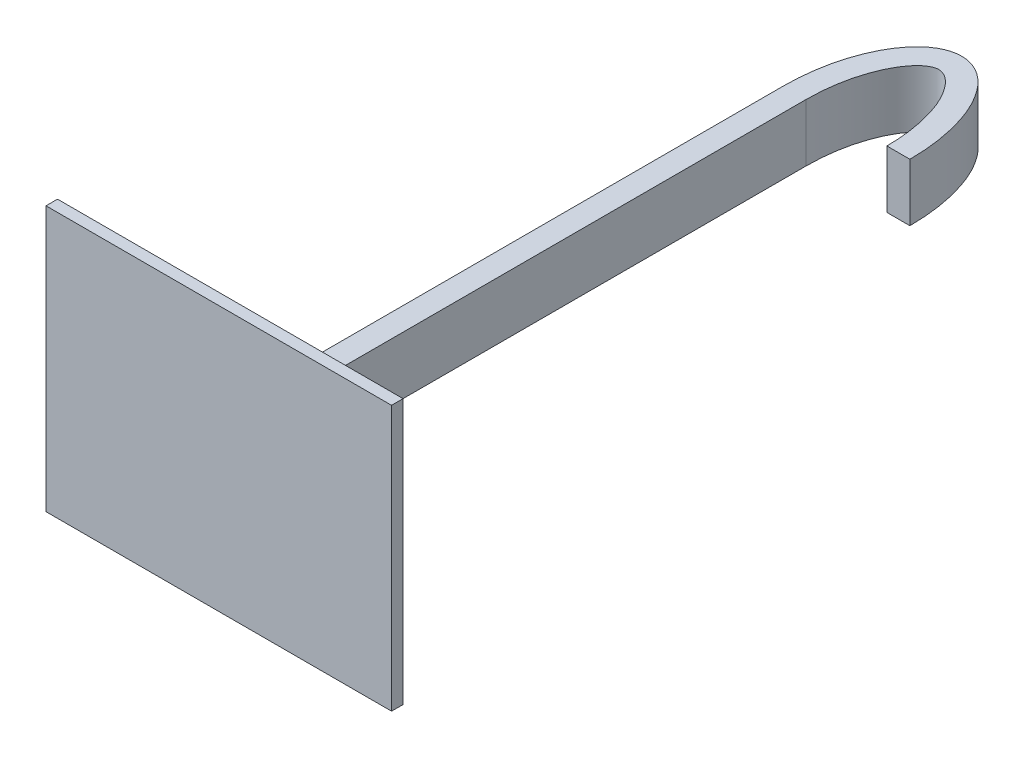
ISO-10303-21;
HEADER;
FILE_DESCRIPTION(('STEP AP214'),'2;1');
FILE_NAME('part.step','',(''),(''),'','','');
FILE_SCHEMA(('AUTOMOTIVE_DESIGN { 1 0 10303 214 1 1 1 1 }'));
ENDSEC;
DATA;
#1=APPLICATION_CONTEXT('core data for automotive mechanical design processes');
#2=APPLICATION_PROTOCOL_DEFINITION('international standard','automotive_design',2000,#1);
#3=PRODUCT_CONTEXT('',#1,'mechanical');
#4=PRODUCT('Part','Part','',(#3));
#5=PRODUCT_RELATED_PRODUCT_CATEGORY('part','',(#4));
#6=PRODUCT_DEFINITION_FORMATION('','',#4);
#7=PRODUCT_DEFINITION_CONTEXT('part definition',#1,'design');
#8=PRODUCT_DEFINITION('design','',#6,#7);
#9=PRODUCT_DEFINITION_SHAPE('','',#8);
#10=(LENGTH_UNIT() NAMED_UNIT(*) SI_UNIT(.MILLI.,.METRE.));
#11=(NAMED_UNIT(*) PLANE_ANGLE_UNIT() SI_UNIT($,.RADIAN.));
#12=(NAMED_UNIT(*) SI_UNIT($,.STERADIAN.) SOLID_ANGLE_UNIT());
#13=UNCERTAINTY_MEASURE_WITH_UNIT(LENGTH_MEASURE(1.E-05),#10,'distance_accuracy_value','');
#14=(GEOMETRIC_REPRESENTATION_CONTEXT(3) GLOBAL_UNCERTAINTY_ASSIGNED_CONTEXT((#13)) GLOBAL_UNIT_ASSIGNED_CONTEXT((#10,
#11,#12)) REPRESENTATION_CONTEXT('',''));
#15=CARTESIAN_POINT('',(0.,0.,0.));
#16=DIRECTION('',(0.,0.,1.));
#17=DIRECTION('',(1.,0.,0.));
#18=AXIS2_PLACEMENT_3D('',#15,#16,#17);
#19=CARTESIAN_POINT('',(15.,11.5,1.));
#20=DIRECTION('',(0.,-1.,0.));
#21=DIRECTION('',(1.,0.,0.));
#22=AXIS2_PLACEMENT_3D('',#19,#20,#21);
#23=PLANE('',#22);
#24=DIRECTION('',(-1.,0.,0.));
#25=VECTOR('',#24,1.);
#26=CARTESIAN_POINT('',(15.,11.5,0.));
#27=LINE('',#26,#25);
#28=CARTESIAN_POINT('',(15.,11.5,0.));
#29=VERTEX_POINT('',#28);
#30=CARTESIAN_POINT('',(-15.,11.5,0.));
#31=VERTEX_POINT('',#30);
#32=EDGE_CURVE('E215',#29,#31,#27,.T.);
#33=ORIENTED_EDGE('',*,*,#32,.T.);
#34=DIRECTION('',(0.,0.,-1.));
#35=VECTOR('',#34,1.);
#36=CARTESIAN_POINT('',(-15.,11.5,1.));
#37=LINE('',#36,#35);
#38=CARTESIAN_POINT('',(-15.,11.5,1.));
#39=VERTEX_POINT('',#38);
#40=EDGE_CURVE('E209',#39,#31,#37,.T.);
#41=ORIENTED_EDGE('',*,*,#40,.F.);
#42=DIRECTION('',(-1.,0.,0.));
#43=VECTOR('',#42,1.);
#44=CARTESIAN_POINT('',(15.,11.5,1.));
#45=LINE('',#44,#43);
#46=CARTESIAN_POINT('',(15.,11.5,1.));
#47=VERTEX_POINT('',#46);
#48=EDGE_CURVE('E95',#47,#39,#45,.T.);
#49=ORIENTED_EDGE('',*,*,#48,.F.);
#50=DIRECTION('',(0.,0.,-1.));
#51=VECTOR('',#50,1.);
#52=CARTESIAN_POINT('',(15.,11.5,1.));
#53=LINE('',#52,#51);
#54=EDGE_CURVE('E224',#47,#29,#53,.T.);
#55=ORIENTED_EDGE('',*,*,#54,.T.);
#56=EDGE_LOOP('',(#33,#41,#49,#55));
#57=FACE_BOUND('',#56,.T.);
#58=ADVANCED_FACE('F45',(#57),#23,.F.);
#59=CARTESIAN_POINT('',(-15.,-11.5,1.));
#60=DIRECTION('',(-1.,0.,0.));
#61=DIRECTION('',(0.,-1.,0.));
#62=AXIS2_PLACEMENT_3D('',#59,#60,#61);
#63=PLANE('',#62);
#64=DIRECTION('',(0.,1.,0.));
#65=VECTOR('',#64,1.);
#66=CARTESIAN_POINT('',(-15.,-11.5,0.));
#67=LINE('',#66,#65);
#68=CARTESIAN_POINT('',(-15.,-11.5,0.));
#69=VERTEX_POINT('',#68);
#70=EDGE_CURVE('E205',#69,#31,#67,.T.);
#71=ORIENTED_EDGE('',*,*,#70,.F.);
#72=DIRECTION('',(0.,0.,-1.));
#73=VECTOR('',#72,1.);
#74=CARTESIAN_POINT('',(-15.,-11.5,1.));
#75=LINE('',#74,#73);
#76=CARTESIAN_POINT('',(-15.,-11.5,1.));
#77=VERTEX_POINT('',#76);
#78=EDGE_CURVE('E208',#77,#69,#75,.T.);
#79=ORIENTED_EDGE('',*,*,#78,.F.);
#80=DIRECTION('',(0.,1.,0.));
#81=VECTOR('',#80,1.);
#82=CARTESIAN_POINT('',(-15.,-11.5,1.));
#83=LINE('',#82,#81);
#84=EDGE_CURVE('E264',#77,#39,#83,.T.);
#85=ORIENTED_EDGE('',*,*,#84,.T.);
#86=ORIENTED_EDGE('',*,*,#40,.T.);
#87=EDGE_LOOP('',(#71,#79,#85,#86));
#88=FACE_BOUND('',#87,.T.);
#89=ADVANCED_FACE('F195',(#88),#63,.T.);
#90=CARTESIAN_POINT('',(15.,-11.5,1.));
#91=DIRECTION('',(0.,-1.,0.));
#92=DIRECTION('',(1.,0.,0.));
#93=AXIS2_PLACEMENT_3D('',#90,#91,#92);
#94=PLANE('',#93);
#95=DIRECTION('',(-1.,0.,0.));
#96=VECTOR('',#95,1.);
#97=CARTESIAN_POINT('',(15.,-11.5,0.));
#98=LINE('',#97,#96);
#99=CARTESIAN_POINT('',(15.,-11.5,0.));
#100=VERTEX_POINT('',#99);
#101=EDGE_CURVE('E214',#100,#69,#98,.T.);
#102=ORIENTED_EDGE('',*,*,#101,.F.);
#103=DIRECTION('',(0.,0.,-1.));
#104=VECTOR('',#103,1.);
#105=CARTESIAN_POINT('',(15.,-11.5,1.));
#106=LINE('',#105,#104);
#107=CARTESIAN_POINT('',(15.,-11.5,1.));
#108=VERTEX_POINT('',#107);
#109=EDGE_CURVE('E227',#108,#100,#106,.T.);
#110=ORIENTED_EDGE('',*,*,#109,.F.);
#111=DIRECTION('',(-1.,0.,0.));
#112=VECTOR('',#111,1.);
#113=CARTESIAN_POINT('',(15.,-11.5,1.));
#114=LINE('',#113,#112);
#115=EDGE_CURVE('E267',#108,#77,#114,.T.);
#116=ORIENTED_EDGE('',*,*,#115,.T.);
#117=ORIENTED_EDGE('',*,*,#78,.T.);
#118=EDGE_LOOP('',(#102,#110,#116,#117));
#119=FACE_BOUND('',#118,.T.);
#120=ADVANCED_FACE('F193',(#119),#94,.T.);
#121=CARTESIAN_POINT('',(15.,-11.5,1.));
#122=DIRECTION('',(-1.,0.,0.));
#123=DIRECTION('',(0.,0.,1.));
#124=AXIS2_PLACEMENT_3D('',#121,#122,#123);
#125=PLANE('',#124);
#126=DIRECTION('',(0.,1.,0.));
#127=VECTOR('',#126,1.);
#128=CARTESIAN_POINT('',(15.,-11.5,0.));
#129=LINE('',#128,#127);
#130=EDGE_CURVE('E90',#100,#29,#129,.T.);
#131=ORIENTED_EDGE('',*,*,#130,.T.);
#132=ORIENTED_EDGE('',*,*,#54,.F.);
#133=DIRECTION('',(0.,1.,0.));
#134=VECTOR('',#133,1.);
#135=CARTESIAN_POINT('',(15.,-11.5,1.));
#136=LINE('',#135,#134);
#137=EDGE_CURVE('E69',#108,#47,#136,.T.);
#138=ORIENTED_EDGE('',*,*,#137,.F.);
#139=ORIENTED_EDGE('',*,*,#109,.T.);
#140=EDGE_LOOP('',(#131,#132,#138,#139));
#141=FACE_BOUND('',#140,.T.);
#142=ADVANCED_FACE('F187',(#141),#125,.F.);
#143=CARTESIAN_POINT('',(0.,0.,1.));
#144=DIRECTION('',(0.,0.,-1.));
#145=DIRECTION('',(-1.,0.,0.));
#146=AXIS2_PLACEMENT_3D('',#143,#144,#145);
#147=PLANE('',#146);
#148=ORIENTED_EDGE('',*,*,#48,.T.);
#149=ORIENTED_EDGE('',*,*,#84,.F.);
#150=ORIENTED_EDGE('',*,*,#115,.F.);
#151=ORIENTED_EDGE('',*,*,#137,.T.);
#152=EDGE_LOOP('',(#148,#149,#150,#151));
#153=FACE_BOUND('',#152,.T.);
#154=ADVANCED_FACE('F184',(#153),#147,.F.);
#155=CARTESIAN_POINT('',(0.,0.,0.));
#156=DIRECTION('',(0.,0.,-1.));
#157=DIRECTION('',(-1.,0.,0.));
#158=AXIS2_PLACEMENT_3D('',#155,#156,#157);
#159=PLANE('',#158);
#160=DIRECTION('',(1.,0.,0.));
#161=VECTOR('',#160,1.);
#162=CARTESIAN_POINT('',(0.,2.5,0.));
#163=LINE('',#162,#161);
#164=CARTESIAN_POINT('',(-1.,2.5,0.));
#165=VERTEX_POINT('',#164);
#166=CARTESIAN_POINT('',(1.,2.5,0.));
#167=VERTEX_POINT('',#166);
#168=EDGE_CURVE('E11',#165,#167,#163,.T.);
#169=ORIENTED_EDGE('',*,*,#168,.F.);
#170=DIRECTION('',(0.,-1.,0.));
#171=VECTOR('',#170,1.);
#172=CARTESIAN_POINT('',(-1.,0.,0.));
#173=LINE('',#172,#171);
#174=CARTESIAN_POINT('',(-1.,-2.5,0.));
#175=VERTEX_POINT('',#174);
#176=EDGE_CURVE('E234',#165,#175,#173,.T.);
#177=ORIENTED_EDGE('',*,*,#176,.T.);
#178=DIRECTION('',(1.,0.,0.));
#179=VECTOR('',#178,1.);
#180=CARTESIAN_POINT('',(0.,-2.5,0.));
#181=LINE('',#180,#179);
#182=CARTESIAN_POINT('',(1.,-2.5,0.));
#183=VERTEX_POINT('',#182);
#184=EDGE_CURVE('E238',#175,#183,#181,.T.);
#185=ORIENTED_EDGE('',*,*,#184,.T.);
#186=DIRECTION('',(0.,-1.,0.));
#187=VECTOR('',#186,1.);
#188=CARTESIAN_POINT('',(1.,0.,0.));
#189=LINE('',#188,#187);
#190=EDGE_CURVE('E53',#167,#183,#189,.T.);
#191=ORIENTED_EDGE('',*,*,#190,.F.);
#192=EDGE_LOOP('',(#169,#177,#185,#191));
#193=FACE_BOUND('',#192,.T.);
#194=ORIENTED_EDGE('',*,*,#32,.F.);
#195=ORIENTED_EDGE('',*,*,#130,.F.);
#196=ORIENTED_EDGE('',*,*,#101,.T.);
#197=ORIENTED_EDGE('',*,*,#70,.T.);
#198=EDGE_LOOP('',(#194,#195,#196,#197));
#199=FACE_BOUND('',#198,.T.);
#200=ADVANCED_FACE('F183',(#193,#199),#159,.T.);
#201=CARTESIAN_POINT('',(1.,2.5,-49.));
#202=DIRECTION('',(0.,1.,0.));
#203=DIRECTION('',(0.,0.,1.));
#204=AXIS2_PLACEMENT_3D('',#201,#202,#203);
#205=PLANE('',#204);
#206=DIRECTION('',(0.,0.,1.));
#207=VECTOR('',#206,1.);
#208=CARTESIAN_POINT('',(-1.,2.5,-49.));
#209=LINE('',#208,#207);
#210=CARTESIAN_POINT('',(-1.,2.5,-49.));
#211=VERTEX_POINT('',#210);
#212=EDGE_CURVE('E253',#211,#165,#209,.T.);
#213=ORIENTED_EDGE('',*,*,#212,.T.);
#214=ORIENTED_EDGE('',*,*,#168,.T.);
#215=DIRECTION('',(0.,0.,1.));
#216=VECTOR('',#215,1.);
#217=CARTESIAN_POINT('',(1.,2.5,-49.));
#218=LINE('',#217,#216);
#219=CARTESIAN_POINT('',(1.,2.5,-49.));
#220=VERTEX_POINT('',#219);
#221=EDGE_CURVE('E248',#220,#167,#218,.T.);
#222=ORIENTED_EDGE('',*,*,#221,.F.);
#223=CARTESIAN_POINT('',(0.999999999999999,2.5,-49.));
#224=CARTESIAN_POINT('',(0.999999999999999,2.5,-49.6198680867281));
#225=CARTESIAN_POINT('',(1.0730756575125,2.5,-50.8758469686418));
#226=CARTESIAN_POINT('',(1.49689421214471,2.5,-53.2328530606656));
#227=CARTESIAN_POINT('',(2.29845508213425,2.5,-55.1774297570282));
#228=CARTESIAN_POINT('',(3.22513657938803,2.5,-56.3663973597264));
#229=CARTESIAN_POINT('',(3.86327897564549,2.5,-56.8541768171105));
#230=CARTESIAN_POINT('',(4.33370399551238,2.5,-57.0103538309435));
#231=CARTESIAN_POINT('',(4.69694493447439,2.5,-57.0059457273064));
#232=CARTESIAN_POINT('',(5.18172793382895,2.5,-56.8293031777016));
#233=CARTESIAN_POINT('',(6.04687605201348,2.5,-56.1395774543052));
#234=CARTESIAN_POINT('',(7.22646874439539,2.5,-54.2467642018162));
#235=CARTESIAN_POINT('',(7.86560728538002,2.5,-51.549457001762));
#236=CARTESIAN_POINT('',(8.00268709833732,2.5,-49.5774427436077));
#237=CARTESIAN_POINT('',(8.00251298718185,2.5,-48.3233106955911));
#238=CARTESIAN_POINT('',(7.93780970792626,2.5,-47.4967039061446));
#239=CARTESIAN_POINT('',(7.87465856997124,2.5,-47.0000000000106));
#240=B_SPLINE_CURVE_WITH_KNOTS('',3,(#223,#224,#225,#226,#227,#228,#229,#230,#231,#232,#233,
#234,#235,#236,#237,#238,#239),.UNSPECIFIED.,.F.,.F.,(4,1,1,1,1,1,1,1,1,1,1,1,1,1,4),
(-1.5707963267949,-1.36024841182372,-1.14970049685255,-0.728604666910203,-0.51805675193903,
-0.307508836967857,-0.0969609219966833,0.11358699297449,0.324134907945663,0.534682822916837,
0.955778652859183,1.37687448280153,1.51400283030765,1.62758982328214,1.79797031274388),.UNSPECIFIED.);
#241=CARTESIAN_POINT('',(8.,2.5,-49.));
#242=VERTEX_POINT('',#241);
#243=EDGE_CURVE('E137',#220,#242,#240,.T.);
#244=ORIENTED_EDGE('',*,*,#243,.T.);
#245=DIRECTION('',(1.,0.,0.));
#246=VECTOR('',#245,1.);
#247=CARTESIAN_POINT('',(8.,2.5,-49.));
#248=LINE('',#247,#246);
#249=CARTESIAN_POINT('',(10.,2.5,-49.));
#250=VERTEX_POINT('',#249);
#251=EDGE_CURVE('E130',#242,#250,#248,.T.);
#252=ORIENTED_EDGE('',*,*,#251,.T.);
#253=CARTESIAN_POINT('',(4.5,2.5,-49.));
#254=DIRECTION('',(0.,-1.,0.));
#255=DIRECTION('',(0.,0.,-1.));
#256=AXIS2_PLACEMENT_3D('',#253,#254,#255);
#257=ELLIPSE('',#256,9.99999999999999,5.5);
#258=EDGE_CURVE('E135',#211,#250,#257,.T.);
#259=ORIENTED_EDGE('',*,*,#258,.F.);
#260=EDGE_LOOP('',(#213,#214,#222,#244,#252,#259));
#261=FACE_BOUND('',#260,.T.);
#262=ADVANCED_FACE('F133',(#261),#205,.T.);
#263=CARTESIAN_POINT('',(1.,-2.5,-49.));
#264=DIRECTION('',(1.,0.,0.));
#265=DIRECTION('',(0.,0.,-1.));
#266=AXIS2_PLACEMENT_3D('',#263,#264,#265);
#267=PLANE('',#266);
#268=ORIENTED_EDGE('',*,*,#221,.T.);
#269=ORIENTED_EDGE('',*,*,#190,.T.);
#270=DIRECTION('',(0.,0.,1.));
#271=VECTOR('',#270,1.);
#272=CARTESIAN_POINT('',(1.,-2.5,-49.));
#273=LINE('',#272,#271);
#274=CARTESIAN_POINT('',(1.,-2.5,-49.));
#275=VERTEX_POINT('',#274);
#276=EDGE_CURVE('E246',#275,#183,#273,.T.);
#277=ORIENTED_EDGE('',*,*,#276,.F.);
#278=DIRECTION('',(0.,1.,0.));
#279=VECTOR('',#278,1.);
#280=CARTESIAN_POINT('',(1.,-2.5,-49.));
#281=LINE('',#280,#279);
#282=EDGE_CURVE('E255',#275,#220,#281,.T.);
#283=ORIENTED_EDGE('',*,*,#282,.T.);
#284=EDGE_LOOP('',(#268,#269,#277,#283));
#285=FACE_BOUND('',#284,.T.);
#286=ADVANCED_FACE('F171',(#285),#267,.T.);
#287=CARTESIAN_POINT('',(1.,-2.5,-49.));
#288=DIRECTION('',(0.,1.,0.));
#289=DIRECTION('',(-1.,0.,0.));
#290=AXIS2_PLACEMENT_3D('',#287,#288,#289);
#291=PLANE('',#290);
#292=ORIENTED_EDGE('',*,*,#184,.F.);
#293=DIRECTION('',(0.,0.,1.));
#294=VECTOR('',#293,1.);
#295=CARTESIAN_POINT('',(-1.,-2.5,-49.));
#296=LINE('',#295,#294);
#297=CARTESIAN_POINT('',(-1.,-2.5,-49.));
#298=VERTEX_POINT('',#297);
#299=EDGE_CURVE('E60',#298,#175,#296,.T.);
#300=ORIENTED_EDGE('',*,*,#299,.F.);
#301=CARTESIAN_POINT('',(4.5,-2.5,-49.));
#302=DIRECTION('',(0.,-1.,0.));
#303=DIRECTION('',(0.,0.,-1.));
#304=AXIS2_PLACEMENT_3D('',#301,#302,#303);
#305=ELLIPSE('',#304,9.99999999999999,5.5);
#306=CARTESIAN_POINT('',(10.,-2.5,-49.));
#307=VERTEX_POINT('',#306);
#308=EDGE_CURVE('E287',#298,#307,#305,.T.);
#309=ORIENTED_EDGE('',*,*,#308,.T.);
#310=DIRECTION('',(1.,0.,0.));
#311=VECTOR('',#310,1.);
#312=CARTESIAN_POINT('',(8.,-2.5,-49.));
#313=LINE('',#312,#311);
#314=CARTESIAN_POINT('',(8.,-2.5,-49.));
#315=VERTEX_POINT('',#314);
#316=EDGE_CURVE('E147',#315,#307,#313,.T.);
#317=ORIENTED_EDGE('',*,*,#316,.F.);
#318=CARTESIAN_POINT('',(1.,-2.5,-49.));
#319=CARTESIAN_POINT('',(1.,-2.5,-49.6198680867281));
#320=CARTESIAN_POINT('',(1.0730756575125,-2.5,-50.8758469686418));
#321=CARTESIAN_POINT('',(1.49689421214471,-2.5,-53.2328530606656));
#322=CARTESIAN_POINT('',(2.29845508213425,-2.5,-55.1774297570282));
#323=CARTESIAN_POINT('',(3.22513657938804,-2.5,-56.3663973597264));
#324=CARTESIAN_POINT('',(3.86327897564549,-2.5,-56.8541768171105));
#325=CARTESIAN_POINT('',(4.33370399551238,-2.5,-57.0103538309435));
#326=CARTESIAN_POINT('',(4.69694493447439,-2.5,-57.0059457273064));
#327=CARTESIAN_POINT('',(5.18172793382895,-2.5,-56.8293031777016));
#328=CARTESIAN_POINT('',(6.04687605201348,-2.5,-56.1395774543052));
#329=CARTESIAN_POINT('',(7.22646874439539,-2.5,-54.2467642018162));
#330=CARTESIAN_POINT('',(7.86560728538002,-2.5,-51.549457001762));
#331=CARTESIAN_POINT('',(8.00268709833732,-2.5,-49.5774427436077));
#332=CARTESIAN_POINT('',(8.00251298718185,-2.5,-48.3233106955911));
#333=CARTESIAN_POINT('',(7.93780970792626,-2.5,-47.4967039061446));
#334=CARTESIAN_POINT('',(7.87465856997124,-2.5,-47.0000000000106));
#335=B_SPLINE_CURVE_WITH_KNOTS('',3,(#318,#319,#320,#321,#322,#323,#324,#325,#326,#327,#328,
#329,#330,#331,#332,#333,#334),.UNSPECIFIED.,.F.,.F.,(4,1,1,1,1,1,1,1,1,1,1,1,1,1,4),
(-1.5707963267949,-1.36024841182372,-1.14970049685255,-0.728604666910203,-0.51805675193903,
-0.307508836967857,-0.0969609219966833,0.11358699297449,0.324134907945663,0.534682822916837,
0.955778652859183,1.37687448280153,1.51400283030765,1.62758982328214,1.79797031274388),.UNSPECIFIED.);
#336=EDGE_CURVE('E158',#275,#315,#335,.T.);
#337=ORIENTED_EDGE('',*,*,#336,.F.);
#338=ORIENTED_EDGE('',*,*,#276,.T.);
#339=EDGE_LOOP('',(#292,#300,#309,#317,#337,#338));
#340=FACE_BOUND('',#339,.T.);
#341=ADVANCED_FACE('F174',(#340),#291,.F.);
#342=CARTESIAN_POINT('',(-1.,-2.5,-49.));
#343=DIRECTION('',(1.,0.,0.));
#344=DIRECTION('',(0.,1.,0.));
#345=AXIS2_PLACEMENT_3D('',#342,#343,#344);
#346=PLANE('',#345);
#347=ORIENTED_EDGE('',*,*,#176,.F.);
#348=ORIENTED_EDGE('',*,*,#212,.F.);
#349=DIRECTION('',(0.,1.,0.));
#350=VECTOR('',#349,1.);
#351=CARTESIAN_POINT('',(-1.,-2.5,-49.));
#352=LINE('',#351,#350);
#353=EDGE_CURVE('E156',#298,#211,#352,.T.);
#354=ORIENTED_EDGE('',*,*,#353,.F.);
#355=ORIENTED_EDGE('',*,*,#299,.T.);
#356=EDGE_LOOP('',(#347,#348,#354,#355));
#357=FACE_BOUND('',#356,.T.);
#358=ADVANCED_FACE('F169',(#357),#346,.F.);
#359=DIRECTION('',(0.,-1.,0.));
#360=VECTOR('',#359,1.);
#361=SURFACE_OF_LINEAR_EXTRUSION('',#257,#360);
#362=ORIENTED_EDGE('',*,*,#308,.F.);
#363=ORIENTED_EDGE('',*,*,#353,.T.);
#364=ORIENTED_EDGE('',*,*,#258,.T.);
#365=DIRECTION('',(0.,-1.,0.));
#366=VECTOR('',#365,1.);
#367=CARTESIAN_POINT('',(10.,2.5,-49.));
#368=LINE('',#367,#366);
#369=EDGE_CURVE('E144',#250,#307,#368,.T.);
#370=ORIENTED_EDGE('',*,*,#369,.T.);
#371=EDGE_LOOP('',(#362,#363,#364,#370));
#372=FACE_BOUND('',#371,.T.);
#373=ADVANCED_FACE('F155',(#372),#361,.T.);
#374=DIRECTION('',(0.,-1.,0.));
#375=VECTOR('',#374,1.);
#376=SURFACE_OF_LINEAR_EXTRUSION('',#240,#375);
#377=ORIENTED_EDGE('',*,*,#336,.T.);
#378=DIRECTION('',(0.,-1.,0.));
#379=VECTOR('',#378,1.);
#380=CARTESIAN_POINT('',(8.,2.5,-49.));
#381=LINE('',#380,#379);
#382=EDGE_CURVE('E152',#242,#315,#381,.T.);
#383=ORIENTED_EDGE('',*,*,#382,.F.);
#384=ORIENTED_EDGE('',*,*,#243,.F.);
#385=ORIENTED_EDGE('',*,*,#282,.F.);
#386=EDGE_LOOP('',(#377,#383,#384,#385));
#387=FACE_BOUND('',#386,.T.);
#388=ADVANCED_FACE('F168',(#387),#376,.F.);
#389=CARTESIAN_POINT('',(8.,2.5,-49.));
#390=DIRECTION('',(0.,0.,-1.));
#391=DIRECTION('',(-1.,0.,0.));
#392=AXIS2_PLACEMENT_3D('',#389,#390,#391);
#393=PLANE('',#392);
#394=ORIENTED_EDGE('',*,*,#316,.T.);
#395=ORIENTED_EDGE('',*,*,#369,.F.);
#396=ORIENTED_EDGE('',*,*,#251,.F.);
#397=ORIENTED_EDGE('',*,*,#382,.T.);
#398=EDGE_LOOP('',(#394,#395,#396,#397));
#399=FACE_BOUND('',#398,.T.);
#400=ADVANCED_FACE('F145',(#399),#393,.F.);
#401=CLOSED_SHELL('',(#58,#89,#120,#142,#154,#200,#262,#286,#341,#358,#373,#388,#400));
#402=MANIFOLD_SOLID_BREP('B2',#401);
#403=ADVANCED_BREP_SHAPE_REPRESENTATION('',(#18,#402),#14);
#404=SHAPE_DEFINITION_REPRESENTATION(#9,#403);
ENDSEC;
END-ISO-10303-21;
